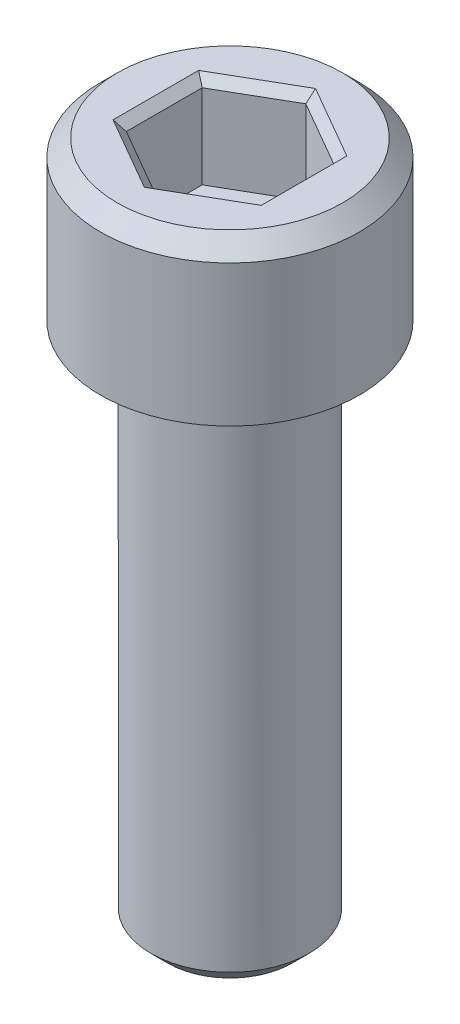
ISO-10303-21;
HEADER;
FILE_DESCRIPTION(('STEP AP214'),'2;1');
FILE_NAME('part.step','',(''),(''),'','','');
FILE_SCHEMA(('AUTOMOTIVE_DESIGN { 1 0 10303 214 1 1 1 1 }'));
ENDSEC;
DATA;
#1=APPLICATION_CONTEXT('core data for automotive mechanical design processes');
#2=APPLICATION_PROTOCOL_DEFINITION('international standard','automotive_design',2000,#1);
#3=PRODUCT_CONTEXT('',#1,'mechanical');
#4=PRODUCT('Part','Part','',(#3));
#5=PRODUCT_RELATED_PRODUCT_CATEGORY('part','',(#4));
#6=PRODUCT_DEFINITION_FORMATION('','',#4);
#7=PRODUCT_DEFINITION_CONTEXT('part definition',#1,'design');
#8=PRODUCT_DEFINITION('design','',#6,#7);
#9=PRODUCT_DEFINITION_SHAPE('','',#8);
#10=(LENGTH_UNIT() NAMED_UNIT(*) SI_UNIT(.MILLI.,.METRE.));
#11=(NAMED_UNIT(*) PLANE_ANGLE_UNIT() SI_UNIT($,.RADIAN.));
#12=(NAMED_UNIT(*) SI_UNIT($,.STERADIAN.) SOLID_ANGLE_UNIT());
#13=UNCERTAINTY_MEASURE_WITH_UNIT(LENGTH_MEASURE(1.E-05),#10,'distance_accuracy_value','');
#14=(GEOMETRIC_REPRESENTATION_CONTEXT(3) GLOBAL_UNCERTAINTY_ASSIGNED_CONTEXT((#13)) GLOBAL_UNIT_ASSIGNED_CONTEXT((#10,
#11,#12)) REPRESENTATION_CONTEXT('',''));
#15=CARTESIAN_POINT('',(0.,0.,0.));
#16=DIRECTION('',(0.,0.,1.));
#17=DIRECTION('',(1.,0.,0.));
#18=AXIS2_PLACEMENT_3D('',#15,#16,#17);
#19=CARTESIAN_POINT('',(-3.96874999999999,-2.794,0.));
#20=DIRECTION('',(0.,-1.,0.));
#21=DIRECTION('',(0.,0.,-1.));
#22=AXIS2_PLACEMENT_3D('',#19,#20,#21);
#23=PLANE('',#22);
#24=DIRECTION('',(-0.866025403784439,0.,0.5));
#25=VECTOR('',#24,1.);
#26=CARTESIAN_POINT('',(1.98437500000001,-2.794,1.14567944042317));
#27=LINE('',#26,#25);
#28=CARTESIAN_POINT('',(1.98437500000001,-2.794,1.14567944042317));
#29=VERTEX_POINT('',#28);
#30=CARTESIAN_POINT('',(0.,-2.794,2.29135888084634));
#31=VERTEX_POINT('',#30);
#32=EDGE_CURVE('E85',#29,#31,#27,.T.);
#33=ORIENTED_EDGE('',*,*,#32,.F.);
#34=DIRECTION('',(0.,0.,1.));
#35=VECTOR('',#34,1.);
#36=CARTESIAN_POINT('',(1.98437500000001,-2.794,-1.14567944042316));
#37=LINE('',#36,#35);
#38=CARTESIAN_POINT('',(1.98437500000001,-2.794,-1.14567944042316));
#39=VERTEX_POINT('',#38);
#40=EDGE_CURVE('E90',#39,#29,#37,.T.);
#41=ORIENTED_EDGE('',*,*,#40,.F.);
#42=DIRECTION('',(0.866025403784439,0.,0.5));
#43=VECTOR('',#42,1.);
#44=CARTESIAN_POINT('',(0.,-2.794,-2.29135888084632));
#45=LINE('',#44,#43);
#46=CARTESIAN_POINT('',(0.,-2.794,-2.29135888084632));
#47=VERTEX_POINT('',#46);
#48=EDGE_CURVE('E175',#47,#39,#45,.T.);
#49=ORIENTED_EDGE('',*,*,#48,.F.);
#50=DIRECTION('',(0.866025403784438,0.,-0.5));
#51=VECTOR('',#50,1.);
#52=CARTESIAN_POINT('',(-1.98437499999999,-2.794,-1.14567944042316));
#53=LINE('',#52,#51);
#54=CARTESIAN_POINT('',(-1.984375,-2.794,-1.14567944042316));
#55=VERTEX_POINT('',#54);
#56=EDGE_CURVE('E181',#55,#47,#53,.T.);
#57=ORIENTED_EDGE('',*,*,#56,.F.);
#58=DIRECTION('',(0.,0.,-1.));
#59=VECTOR('',#58,1.);
#60=CARTESIAN_POINT('',(-1.984375,-2.794,1.14567944042317));
#61=LINE('',#60,#59);
#62=CARTESIAN_POINT('',(-1.984375,-2.794,1.14567944042317));
#63=VERTEX_POINT('',#62);
#64=EDGE_CURVE('E186',#63,#55,#61,.T.);
#65=ORIENTED_EDGE('',*,*,#64,.F.);
#66=DIRECTION('',(-0.866025403784438,0.,-0.5));
#67=VECTOR('',#66,1.);
#68=CARTESIAN_POINT('',(0.,-2.794,2.29135888084634));
#69=LINE('',#68,#67);
#70=EDGE_CURVE('E101',#31,#63,#69,.T.);
#71=ORIENTED_EDGE('',*,*,#70,.F.);
#72=EDGE_LOOP('',(#33,#41,#49,#57,#65,#71));
#73=FACE_BOUND('',#72,.T.);
#74=ADVANCED_FACE('F16',(#73),#23,.F.);
#75=CARTESIAN_POINT('',(1.98437500000001,-2.794,-1.14567944042316));
#76=DIRECTION('',(-1.,0.,0.));
#77=DIRECTION('',(0.,0.,1.));
#78=AXIS2_PLACEMENT_3D('',#75,#76,#77);
#79=PLANE('',#78);
#80=DIRECTION('',(0.,1.,0.));
#81=VECTOR('',#80,1.);
#82=CARTESIAN_POINT('',(1.98437500000001,-2.794,-1.14567944042316));
#83=LINE('',#82,#81);
#84=CARTESIAN_POINT('',(1.98437500000001,-0.254,-1.14567944042316));
#85=VERTEX_POINT('',#84);
#86=EDGE_CURVE('E95',#39,#85,#83,.T.);
#87=ORIENTED_EDGE('',*,*,#86,.F.);
#88=ORIENTED_EDGE('',*,*,#40,.T.);
#89=DIRECTION('',(0.,1.,0.));
#90=VECTOR('',#89,1.);
#91=CARTESIAN_POINT('',(1.98437500000001,-2.794,1.14567944042317));
#92=LINE('',#91,#90);
#93=CARTESIAN_POINT('',(1.98437500000001,-0.254,1.14567944042317));
#94=VERTEX_POINT('',#93);
#95=EDGE_CURVE('E92',#94,#29,#92,.F.);
#96=ORIENTED_EDGE('',*,*,#95,.F.);
#97=DIRECTION('',(0.,0.,1.));
#98=VECTOR('',#97,1.);
#99=CARTESIAN_POINT('',(1.98437500000001,-0.254,0.));
#100=LINE('',#99,#98);
#101=EDGE_CURVE('E173',#94,#85,#100,.F.);
#102=ORIENTED_EDGE('',*,*,#101,.T.);
#103=EDGE_LOOP('',(#87,#88,#96,#102));
#104=FACE_BOUND('',#103,.T.);
#105=ADVANCED_FACE('F91',(#104),#79,.T.);
#106=CARTESIAN_POINT('',(1.98437500000001,-2.794,1.14567944042317));
#107=DIRECTION('',(-0.5,0.,-0.866025403784439));
#108=DIRECTION('',(-0.866025403784439,0.,0.5));
#109=AXIS2_PLACEMENT_3D('',#106,#107,#108);
#110=PLANE('',#109);
#111=ORIENTED_EDGE('',*,*,#95,.T.);
#112=ORIENTED_EDGE('',*,*,#32,.T.);
#113=DIRECTION('',(0.,1.,0.));
#114=VECTOR('',#113,1.);
#115=CARTESIAN_POINT('',(0.,-2.794,2.29135888084634));
#116=LINE('',#115,#114);
#117=CARTESIAN_POINT('',(0.,-0.253999999999999,2.29135888084634));
#118=VERTEX_POINT('',#117);
#119=EDGE_CURVE('E103',#118,#31,#116,.F.);
#120=ORIENTED_EDGE('',*,*,#119,.F.);
#121=DIRECTION('',(0.866025403784439,0.,-0.5));
#122=VECTOR('',#121,1.);
#123=CARTESIAN_POINT('',(0.,-0.253999999999998,2.29135888084634));
#124=LINE('',#123,#122);
#125=EDGE_CURVE('E107',#118,#94,#124,.T.);
#126=ORIENTED_EDGE('',*,*,#125,.T.);
#127=EDGE_LOOP('',(#111,#112,#120,#126));
#128=FACE_BOUND('',#127,.T.);
#129=ADVANCED_FACE('F105',(#128),#110,.T.);
#130=CARTESIAN_POINT('',(0.,-2.794,2.29135888084634));
#131=DIRECTION('',(0.5,0.,-0.866025403784438));
#132=DIRECTION('',(-0.866025403784438,0.,-0.5));
#133=AXIS2_PLACEMENT_3D('',#130,#131,#132);
#134=PLANE('',#133);
#135=ORIENTED_EDGE('',*,*,#119,.T.);
#136=ORIENTED_EDGE('',*,*,#70,.T.);
#137=DIRECTION('',(0.,1.,0.));
#138=VECTOR('',#137,1.);
#139=CARTESIAN_POINT('',(-1.984375,-2.794,1.14567944042317));
#140=LINE('',#139,#138);
#141=CARTESIAN_POINT('',(-1.984375,-0.254,1.14567944042317));
#142=VERTEX_POINT('',#141);
#143=EDGE_CURVE('E188',#142,#63,#140,.F.);
#144=ORIENTED_EDGE('',*,*,#143,.F.);
#145=DIRECTION('',(0.866025403784438,0.,0.500000000000001));
#146=VECTOR('',#145,1.);
#147=CARTESIAN_POINT('',(-1.984375,-0.254,1.14567944042317));
#148=LINE('',#147,#146);
#149=EDGE_CURVE('E167',#142,#118,#148,.T.);
#150=ORIENTED_EDGE('',*,*,#149,.T.);
#151=EDGE_LOOP('',(#135,#136,#144,#150));
#152=FACE_BOUND('',#151,.T.);
#153=ADVANCED_FACE('F192',(#152),#134,.T.);
#154=CARTESIAN_POINT('',(-1.984375,-2.794,1.14567944042317));
#155=DIRECTION('',(1.,0.,0.));
#156=DIRECTION('',(0.,0.,-1.));
#157=AXIS2_PLACEMENT_3D('',#154,#155,#156);
#158=PLANE('',#157);
#159=ORIENTED_EDGE('',*,*,#143,.T.);
#160=ORIENTED_EDGE('',*,*,#64,.T.);
#161=DIRECTION('',(0.,1.,0.));
#162=VECTOR('',#161,1.);
#163=CARTESIAN_POINT('',(-1.984375,-2.794,-1.14567944042316));
#164=LINE('',#163,#162);
#165=CARTESIAN_POINT('',(-1.984375,-0.253999999999999,-1.14567944042316));
#166=VERTEX_POINT('',#165);
#167=EDGE_CURVE('E183',#166,#55,#164,.F.);
#168=ORIENTED_EDGE('',*,*,#167,.F.);
#169=DIRECTION('',(0.,0.,1.));
#170=VECTOR('',#169,1.);
#171=CARTESIAN_POINT('',(-1.984375,-0.254,0.));
#172=LINE('',#171,#170);
#173=EDGE_CURVE('E162',#166,#142,#172,.T.);
#174=ORIENTED_EDGE('',*,*,#173,.T.);
#175=EDGE_LOOP('',(#159,#160,#168,#174));
#176=FACE_BOUND('',#175,.T.);
#177=ADVANCED_FACE('F222',(#176),#158,.T.);
#178=CARTESIAN_POINT('',(-1.98437499999999,-2.794,-1.14567944042316));
#179=DIRECTION('',(0.5,0.,0.866025403784438));
#180=DIRECTION('',(0.866025403784438,0.,-0.5));
#181=AXIS2_PLACEMENT_3D('',#178,#179,#180);
#182=PLANE('',#181);
#183=ORIENTED_EDGE('',*,*,#167,.T.);
#184=ORIENTED_EDGE('',*,*,#56,.T.);
#185=DIRECTION('',(0.,1.,0.));
#186=VECTOR('',#185,1.);
#187=CARTESIAN_POINT('',(0.,-2.794,-2.29135888084632));
#188=LINE('',#187,#186);
#189=CARTESIAN_POINT('',(0.,-0.254,-2.29135888084632));
#190=VERTEX_POINT('',#189);
#191=EDGE_CURVE('E177',#190,#47,#188,.F.);
#192=ORIENTED_EDGE('',*,*,#191,.F.);
#193=DIRECTION('',(-0.866025403784439,0.,0.499999999999999));
#194=VECTOR('',#193,1.);
#195=CARTESIAN_POINT('',(0.,-0.253999999999999,-2.29135888084632));
#196=LINE('',#195,#194);
#197=EDGE_CURVE('E157',#190,#166,#196,.T.);
#198=ORIENTED_EDGE('',*,*,#197,.T.);
#199=EDGE_LOOP('',(#183,#184,#192,#198));
#200=FACE_BOUND('',#199,.T.);
#201=ADVANCED_FACE('F218',(#200),#182,.T.);
#202=CARTESIAN_POINT('',(0.,-2.794,-2.29135888084632));
#203=DIRECTION('',(-0.5,0.,0.866025403784439));
#204=DIRECTION('',(0.866025403784439,0.,0.5));
#205=AXIS2_PLACEMENT_3D('',#202,#203,#204);
#206=PLANE('',#205);
#207=ORIENTED_EDGE('',*,*,#191,.T.);
#208=ORIENTED_EDGE('',*,*,#48,.T.);
#209=ORIENTED_EDGE('',*,*,#86,.T.);
#210=DIRECTION('',(-0.866025403784439,0.,-0.499999999999999));
#211=VECTOR('',#210,1.);
#212=CARTESIAN_POINT('',(1.98437500000001,-0.253999999999997,-1.14567944042316));
#213=LINE('',#212,#211);
#214=EDGE_CURVE('E149',#85,#190,#213,.T.);
#215=ORIENTED_EDGE('',*,*,#214,.T.);
#216=EDGE_LOOP('',(#207,#208,#209,#215));
#217=FACE_BOUND('',#216,.T.);
#218=ADVANCED_FACE('F213',(#217),#206,.T.);
#219=CARTESIAN_POINT('',(2.23837500000001,0.,0.));
#220=DIRECTION('',(0.707106781186548,-0.707106781186548,0.));
#221=DIRECTION('',(0.707106781186548,0.707106781186548,0.));
#222=AXIS2_PLACEMENT_3D('',#219,#220,#221);
#223=PLANE('',#222);
#224=ORIENTED_EDGE('',*,*,#101,.F.);
#225=DIRECTION('',(0.654653670707971,0.654653670707979,0.377964473009234));
#226=VECTOR('',#225,1.);
#227=CARTESIAN_POINT('',(1.98437500000001,-0.254,1.14567944042317));
#228=LINE('',#227,#226);
#229=CARTESIAN_POINT('',(2.23837500000001,0.,1.29232640879734));
#230=VERTEX_POINT('',#229);
#231=EDGE_CURVE('E170',#94,#230,#228,.T.);
#232=ORIENTED_EDGE('',*,*,#231,.T.);
#233=DIRECTION('',(0.,0.,1.));
#234=VECTOR('',#233,1.);
#235=CARTESIAN_POINT('',(2.23837500000001,0.,0.));
#236=LINE('',#235,#234);
#237=CARTESIAN_POINT('',(2.23837500000001,0.,-1.29232640879732));
#238=VERTEX_POINT('',#237);
#239=EDGE_CURVE('E145',#238,#230,#236,.T.);
#240=ORIENTED_EDGE('',*,*,#239,.F.);
#241=DIRECTION('',(-0.654653670707983,-0.654653670707975,0.377964473009222));
#242=VECTOR('',#241,1.);
#243=CARTESIAN_POINT('',(2.23837500000001,0.,-1.29232640879732));
#244=LINE('',#243,#242);
#245=EDGE_CURVE('E152',#238,#85,#244,.T.);
#246=ORIENTED_EDGE('',*,*,#245,.T.);
#247=EDGE_LOOP('',(#224,#232,#240,#246));
#248=FACE_BOUND('',#247,.T.);
#249=ADVANCED_FACE('F208',(#248),#223,.F.);
#250=CARTESIAN_POINT('',(1.11918750000001,0.,1.938489613196));
#251=DIRECTION('',(0.353553390593273,-0.707106781186548,0.612372435695794));
#252=DIRECTION('',(0.,-0.654653670707977,-0.755928946018455));
#253=AXIS2_PLACEMENT_3D('',#250,#251,#252);
#254=PLANE('',#253);
#255=ORIENTED_EDGE('',*,*,#125,.F.);
#256=DIRECTION('',(0.,-0.654653670707977,-0.755928946018455));
#257=VECTOR('',#256,1.);
#258=CARTESIAN_POINT('',(0.,-0.319767857142859,2.21541670079543));
#259=LINE('',#258,#257);
#260=CARTESIAN_POINT('',(0.,0.,2.58465281759467));
#261=VERTEX_POINT('',#260);
#262=EDGE_CURVE('E165',#118,#261,#259,.F.);
#263=ORIENTED_EDGE('',*,*,#262,.T.);
#264=DIRECTION('',(-0.866025403784439,0.,0.5));
#265=VECTOR('',#264,1.);
#266=CARTESIAN_POINT('',(2.23837500000001,0.,1.29232640879734));
#267=LINE('',#266,#265);
#268=EDGE_CURVE('E142',#230,#261,#267,.T.);
#269=ORIENTED_EDGE('',*,*,#268,.F.);
#270=ORIENTED_EDGE('',*,*,#231,.F.);
#271=EDGE_LOOP('',(#255,#263,#269,#270));
#272=FACE_BOUND('',#271,.T.);
#273=ADVANCED_FACE('F199',(#272),#254,.F.);
#274=CARTESIAN_POINT('',(-1.1191875,0.,1.938489613196));
#275=DIRECTION('',(-0.353553390593274,-0.707106781186548,0.612372435695794));
#276=DIRECTION('',(0.,-0.654653670707977,-0.755928946018455));
#277=AXIS2_PLACEMENT_3D('',#274,#275,#276);
#278=PLANE('',#277);
#279=DIRECTION('',(-0.866025403784437,0.,-0.500000000000002));
#280=VECTOR('',#279,1.);
#281=CARTESIAN_POINT('',(0.,0.,2.58465281759467));
#282=LINE('',#281,#280);
#283=CARTESIAN_POINT('',(-2.238375,0.,1.29232640879733));
#284=VERTEX_POINT('',#283);
#285=EDGE_CURVE('E139',#261,#284,#282,.T.);
#286=ORIENTED_EDGE('',*,*,#285,.F.);
#287=ORIENTED_EDGE('',*,*,#262,.F.);
#288=ORIENTED_EDGE('',*,*,#149,.F.);
#289=DIRECTION('',(-0.65465367070798,0.65465367070798,0.377964473009216));
#290=VECTOR('',#289,1.);
#291=CARTESIAN_POINT('',(-1.984375,-0.254,1.14567944042317));
#292=LINE('',#291,#290);
#293=EDGE_CURVE('E160',#142,#284,#292,.T.);
#294=ORIENTED_EDGE('',*,*,#293,.T.);
#295=EDGE_LOOP('',(#286,#287,#288,#294));
#296=FACE_BOUND('',#295,.T.);
#297=ADVANCED_FACE('F202',(#296),#278,.F.);
#298=CARTESIAN_POINT('',(-2.238375,0.,0.));
#299=DIRECTION('',(-0.707106781186548,-0.707106781186548,0.));
#300=DIRECTION('',(0.707106781186548,-0.707106781186548,0.));
#301=AXIS2_PLACEMENT_3D('',#298,#299,#300);
#302=PLANE('',#301);
#303=DIRECTION('',(0.,0.,1.));
#304=VECTOR('',#303,1.);
#305=CARTESIAN_POINT('',(-2.238375,0.,0.));
#306=LINE('',#305,#304);
#307=CARTESIAN_POINT('',(-2.238375,0.,-1.29232640879732));
#308=VERTEX_POINT('',#307);
#309=EDGE_CURVE('E136',#284,#308,#306,.F.);
#310=ORIENTED_EDGE('',*,*,#309,.F.);
#311=ORIENTED_EDGE('',*,*,#293,.F.);
#312=ORIENTED_EDGE('',*,*,#173,.F.);
#313=DIRECTION('',(-0.654653670707983,0.654653670707975,-0.377964473009222));
#314=VECTOR('',#313,1.);
#315=CARTESIAN_POINT('',(-1.984375,-0.253999999999995,-1.14567944042316));
#316=LINE('',#315,#314);
#317=EDGE_CURVE('E155',#166,#308,#316,.T.);
#318=ORIENTED_EDGE('',*,*,#317,.T.);
#319=EDGE_LOOP('',(#310,#311,#312,#318));
#320=FACE_BOUND('',#319,.T.);
#321=ADVANCED_FACE('F220',(#320),#302,.F.);
#322=CARTESIAN_POINT('',(-1.1191875,0.,-1.93848961319598));
#323=DIRECTION('',(-0.353553390593274,-0.707106781186548,-0.612372435695794));
#324=DIRECTION('',(0.,0.654653670707977,-0.755928946018455));
#325=AXIS2_PLACEMENT_3D('',#322,#323,#324);
#326=PLANE('',#325);
#327=ORIENTED_EDGE('',*,*,#197,.F.);
#328=DIRECTION('',(0.,0.654653670707977,-0.755928946018455));
#329=VECTOR('',#328,1.);
#330=CARTESIAN_POINT('',(0.,-0.319767857142856,-2.21541670079542));
#331=LINE('',#330,#329);
#332=CARTESIAN_POINT('',(0.,0.,-2.58465281759465));
#333=VERTEX_POINT('',#332);
#334=EDGE_CURVE('E34',#190,#333,#331,.T.);
#335=ORIENTED_EDGE('',*,*,#334,.T.);
#336=DIRECTION('',(0.866025403784439,0.,-0.499999999999999));
#337=VECTOR('',#336,1.);
#338=CARTESIAN_POINT('',(-2.238375,0.,-1.29232640879732));
#339=LINE('',#338,#337);
#340=EDGE_CURVE('E133',#308,#333,#339,.T.);
#341=ORIENTED_EDGE('',*,*,#340,.F.);
#342=ORIENTED_EDGE('',*,*,#317,.F.);
#343=EDGE_LOOP('',(#327,#335,#341,#342));
#344=FACE_BOUND('',#343,.T.);
#345=ADVANCED_FACE('F215',(#344),#326,.F.);
#346=CARTESIAN_POINT('',(1.1191875,0.,-1.93848961319599));
#347=DIRECTION('',(0.353553390593274,-0.707106781186548,-0.612372435695794));
#348=DIRECTION('',(0.,0.654653670707977,-0.755928946018455));
#349=AXIS2_PLACEMENT_3D('',#346,#347,#348);
#350=PLANE('',#349);
#351=ORIENTED_EDGE('',*,*,#214,.F.);
#352=ORIENTED_EDGE('',*,*,#245,.F.);
#353=DIRECTION('',(0.866025403784439,0.,0.5));
#354=VECTOR('',#353,1.);
#355=CARTESIAN_POINT('',(0.,0.,-2.58465281759465));
#356=LINE('',#355,#354);
#357=EDGE_CURVE('E124',#333,#238,#356,.T.);
#358=ORIENTED_EDGE('',*,*,#357,.F.);
#359=ORIENTED_EDGE('',*,*,#334,.F.);
#360=EDGE_LOOP('',(#351,#352,#358,#359));
#361=FACE_BOUND('',#360,.T.);
#362=ADVANCED_FACE('F211',(#361),#350,.F.);
#363=CARTESIAN_POINT('',(0.,0.,0.));
#364=DIRECTION('',(0.,1.,0.));
#365=DIRECTION('',(0.,0.,1.));
#366=AXIS2_PLACEMENT_3D('',#363,#364,#365);
#367=PLANE('',#366);
#368=CARTESIAN_POINT('',(0.,0.,0.));
#369=DIRECTION('',(0.,-1.,0.));
#370=DIRECTION('',(0.,0.,-1.));
#371=AXIS2_PLACEMENT_3D('',#368,#369,#370);
#372=CIRCLE('',#371,3.40360000006967);
#373=CARTESIAN_POINT('',(0.,0.,-3.40360000006967));
#374=VERTEX_POINT('',#373);
#375=EDGE_CURVE('E19',#374,#374,#372,.T.);
#376=ORIENTED_EDGE('',*,*,#375,.F.);
#377=EDGE_LOOP('',(#376));
#378=FACE_BOUND('',#377,.T.);
#379=ORIENTED_EDGE('',*,*,#340,.T.);
#380=ORIENTED_EDGE('',*,*,#357,.T.);
#381=ORIENTED_EDGE('',*,*,#239,.T.);
#382=ORIENTED_EDGE('',*,*,#268,.T.);
#383=ORIENTED_EDGE('',*,*,#285,.T.);
#384=ORIENTED_EDGE('',*,*,#309,.T.);
#385=EDGE_LOOP('',(#379,#380,#381,#382,#383,#384));
#386=FACE_BOUND('',#385,.T.);
#387=ADVANCED_FACE('F205',(#378,#386),#367,.T.);
#388=CARTESIAN_POINT('',(0.,-0.507999999967979,0.));
#389=DIRECTION('',(0.,-1.,0.));
#390=DIRECTION('',(0.,0.,-1.));
#391=AXIS2_PLACEMENT_3D('',#388,#389,#390);
#392=CONICAL_SURFACE('',#391,3.91160000003765,0.785398163397448);
#393=ORIENTED_EDGE('',*,*,#375,.T.);
#394=EDGE_LOOP('',(#393));
#395=FACE_BOUND('',#394,.T.);
#396=CARTESIAN_POINT('',(0.,-0.508,0.));
#397=DIRECTION('',(0.,-1.,0.));
#398=DIRECTION('',(0.,0.,-1.));
#399=AXIS2_PLACEMENT_3D('',#396,#397,#398);
#400=CIRCLE('',#399,3.9116);
#401=CARTESIAN_POINT('',(0.,-0.508,-3.9116));
#402=VERTEX_POINT('',#401);
#403=EDGE_CURVE('E116',#402,#402,#400,.T.);
#404=ORIENTED_EDGE('',*,*,#403,.F.);
#405=EDGE_LOOP('',(#404));
#406=FACE_BOUND('',#405,.T.);
#407=ADVANCED_FACE('F256',(#395,#406),#392,.T.);
#408=CARTESIAN_POINT('',(0.,-20.6502,0.));
#409=DIRECTION('',(0.,1.,0.));
#410=DIRECTION('',(0.,0.,1.));
#411=AXIS2_PLACEMENT_3D('',#408,#409,#410);
#412=PLANE('',#411);
#413=CARTESIAN_POINT('',(0.,-20.6502000000341,0.));
#414=DIRECTION('',(0.,1.,0.));
#415=DIRECTION('',(0.,0.,1.));
#416=AXIS2_PLACEMENT_3D('',#413,#414,#415);
#417=CIRCLE('',#416,1.87959999999521);
#418=CARTESIAN_POINT('',(0.,-20.6502000000341,1.87959999999521));
#419=VERTEX_POINT('',#418);
#420=EDGE_CURVE('E114',#419,#419,#417,.T.);
#421=ORIENTED_EDGE('',*,*,#420,.F.);
#422=EDGE_LOOP('',(#421));
#423=FACE_BOUND('',#422,.T.);
#424=ADVANCED_FACE('F252',(#423),#412,.F.);
#425=CARTESIAN_POINT('',(0.,-4.7752,0.));
#426=DIRECTION('',(0.,-1.,0.));
#427=DIRECTION('',(0.,0.,-1.));
#428=AXIS2_PLACEMENT_3D('',#425,#426,#427);
#429=CYLINDRICAL_SURFACE('',#428,3.9116);
#430=CARTESIAN_POINT('',(0.,-4.7752,0.));
#431=DIRECTION('',(0.,-1.,0.));
#432=DIRECTION('',(0.,0.,-1.));
#433=AXIS2_PLACEMENT_3D('',#430,#431,#432);
#434=CIRCLE('',#433,3.9116);
#435=CARTESIAN_POINT('',(0.,-4.7752,-3.9116));
#436=VERTEX_POINT('',#435);
#437=EDGE_CURVE('E112',#436,#436,#434,.F.);
#438=ORIENTED_EDGE('',*,*,#437,.T.);
#439=EDGE_LOOP('',(#438));
#440=FACE_BOUND('',#439,.T.);
#441=ORIENTED_EDGE('',*,*,#403,.T.);
#442=EDGE_LOOP('',(#441));
#443=FACE_BOUND('',#442,.T.);
#444=ADVANCED_FACE('F248',(#440,#443),#429,.T.);
#445=CARTESIAN_POINT('',(0.,-20.1422000000662,0.));
#446=DIRECTION('',(0.,1.,0.));
#447=DIRECTION('',(0.,0.,1.));
#448=AXIS2_PLACEMENT_3D('',#445,#446,#447);
#449=CONICAL_SURFACE('',#448,2.38759999996319,0.785398163397448);
#450=CARTESIAN_POINT('',(0.,-20.1422,0.));
#451=DIRECTION('',(0.,-1.,0.));
#452=DIRECTION('',(0.,0.,-1.));
#453=AXIS2_PLACEMENT_3D('',#450,#451,#452);
#454=CIRCLE('',#453,2.3876);
#455=CARTESIAN_POINT('',(0.,-20.1422,-2.3876));
#456=VERTEX_POINT('',#455);
#457=EDGE_CURVE('E25',#456,#456,#454,.F.);
#458=ORIENTED_EDGE('',*,*,#457,.F.);
#459=EDGE_LOOP('',(#458));
#460=FACE_BOUND('',#459,.T.);
#461=ORIENTED_EDGE('',*,*,#420,.T.);
#462=EDGE_LOOP('',(#461));
#463=FACE_BOUND('',#462,.T.);
#464=ADVANCED_FACE('F241',(#460,#463),#449,.T.);
#465=CARTESIAN_POINT('',(0.,-4.7752,0.));
#466=DIRECTION('',(0.,1.,0.));
#467=DIRECTION('',(0.,0.,1.));
#468=AXIS2_PLACEMENT_3D('',#465,#466,#467);
#469=PLANE('',#468);
#470=ORIENTED_EDGE('',*,*,#437,.F.);
#471=EDGE_LOOP('',(#470));
#472=FACE_BOUND('',#471,.T.);
#473=CARTESIAN_POINT('',(0.,-4.7752,0.));
#474=DIRECTION('',(0.,-1.,0.));
#475=DIRECTION('',(0.,0.,-1.));
#476=AXIS2_PLACEMENT_3D('',#473,#474,#475);
#477=CIRCLE('',#476,2.3876);
#478=CARTESIAN_POINT('',(0.,-4.7752,-2.3876));
#479=VERTEX_POINT('',#478);
#480=EDGE_CURVE('E11',#479,#479,#477,.T.);
#481=ORIENTED_EDGE('',*,*,#480,.F.);
#482=EDGE_LOOP('',(#481));
#483=FACE_BOUND('',#482,.T.);
#484=ADVANCED_FACE('F235',(#472,#483),#469,.F.);
#485=CARTESIAN_POINT('',(0.,-20.6502,0.));
#486=DIRECTION('',(0.,-1.,0.));
#487=DIRECTION('',(0.,0.,-1.));
#488=AXIS2_PLACEMENT_3D('',#485,#486,#487);
#489=CYLINDRICAL_SURFACE('',#488,2.3876);
#490=ORIENTED_EDGE('',*,*,#480,.T.);
#491=EDGE_LOOP('',(#490));
#492=FACE_BOUND('',#491,.T.);
#493=ORIENTED_EDGE('',*,*,#457,.T.);
#494=EDGE_LOOP('',(#493));
#495=FACE_BOUND('',#494,.T.);
#496=ADVANCED_FACE('F233',(#492,#495),#489,.T.);
#497=CLOSED_SHELL('',(#74,#105,#129,#153,#177,#201,#218,#249,#273,#297,#321,#345,#362,#387,#407,
#424,#444,#464,#484,#496));
#498=MANIFOLD_SOLID_BREP('B1',#497);
#499=ADVANCED_BREP_SHAPE_REPRESENTATION('',(#18,#498),#14);
#500=SHAPE_DEFINITION_REPRESENTATION(#9,#499);
ENDSEC;
END-ISO-10303-21;
